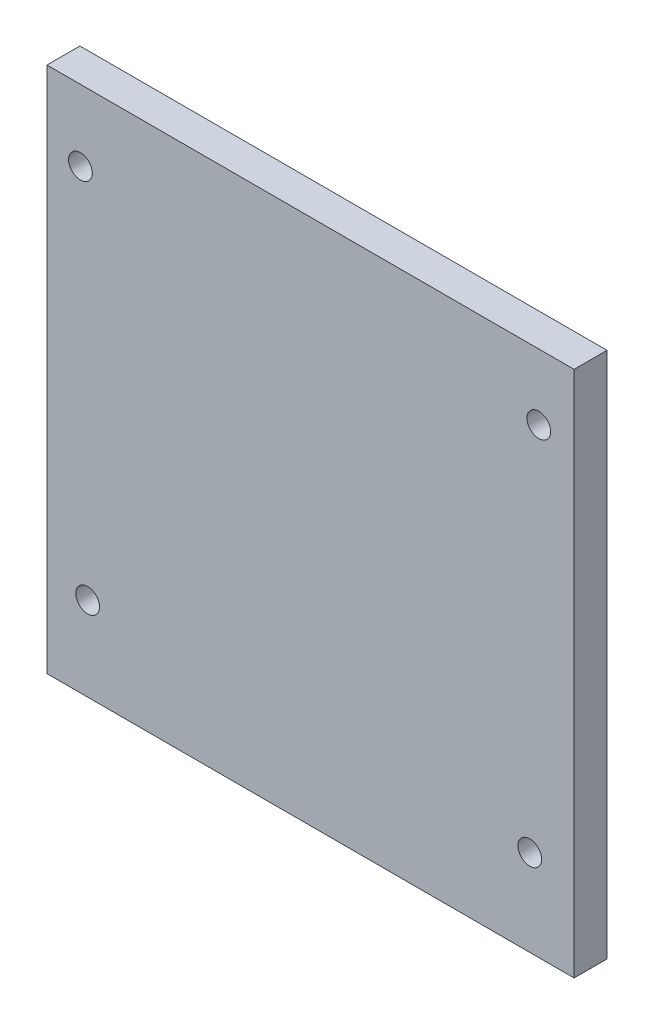
ISO-10303-21;
HEADER;
FILE_DESCRIPTION(('STEP AP214'),'2;1');
FILE_NAME('part.step','',(''),(''),'','','');
FILE_SCHEMA(('AUTOMOTIVE_DESIGN { 1 0 10303 214 1 1 1 1 }'));
ENDSEC;
DATA;
#1=APPLICATION_CONTEXT('core data for automotive mechanical design processes');
#2=APPLICATION_PROTOCOL_DEFINITION('international standard','automotive_design',2000,#1);
#3=PRODUCT_CONTEXT('',#1,'mechanical');
#4=PRODUCT('Part','Part','',(#3));
#5=PRODUCT_RELATED_PRODUCT_CATEGORY('part','',(#4));
#6=PRODUCT_DEFINITION_FORMATION('','',#4);
#7=PRODUCT_DEFINITION_CONTEXT('part definition',#1,'design');
#8=PRODUCT_DEFINITION('design','',#6,#7);
#9=PRODUCT_DEFINITION_SHAPE('','',#8);
#10=(LENGTH_UNIT() NAMED_UNIT(*) SI_UNIT(.MILLI.,.METRE.));
#11=(NAMED_UNIT(*) PLANE_ANGLE_UNIT() SI_UNIT($,.RADIAN.));
#12=(NAMED_UNIT(*) SI_UNIT($,.STERADIAN.) SOLID_ANGLE_UNIT());
#13=UNCERTAINTY_MEASURE_WITH_UNIT(LENGTH_MEASURE(1.E-05),#10,'distance_accuracy_value','');
#14=(GEOMETRIC_REPRESENTATION_CONTEXT(3) GLOBAL_UNCERTAINTY_ASSIGNED_CONTEXT((#13)) GLOBAL_UNIT_ASSIGNED_CONTEXT((#10,
#11,#12)) REPRESENTATION_CONTEXT('',''));
#15=CARTESIAN_POINT('',(0.,0.,0.));
#16=DIRECTION('',(0.,0.,1.));
#17=DIRECTION('',(1.,0.,0.));
#18=AXIS2_PLACEMENT_3D('',#15,#16,#17);
#19=CARTESIAN_POINT('',(50.8,-50.8,6.35));
#20=DIRECTION('',(-1.,0.,0.));
#21=DIRECTION('',(0.,0.,1.));
#22=AXIS2_PLACEMENT_3D('',#19,#20,#21);
#23=PLANE('',#22);
#24=DIRECTION('',(0.,1.,0.));
#25=VECTOR('',#24,1.);
#26=CARTESIAN_POINT('',(50.8,-50.8,0.));
#27=LINE('',#26,#25);
#28=CARTESIAN_POINT('',(50.8,-50.8,0.));
#29=VERTEX_POINT('',#28);
#30=CARTESIAN_POINT('',(50.8,50.8,0.));
#31=VERTEX_POINT('',#30);
#32=EDGE_CURVE('E107',#29,#31,#27,.T.);
#33=ORIENTED_EDGE('',*,*,#32,.T.);
#34=DIRECTION('',(0.,0.,-1.));
#35=VECTOR('',#34,1.);
#36=CARTESIAN_POINT('',(50.8,50.8,6.35));
#37=LINE('',#36,#35);
#38=CARTESIAN_POINT('',(50.8,50.8,6.35));
#39=VERTEX_POINT('',#38);
#40=EDGE_CURVE('E13',#39,#31,#37,.T.);
#41=ORIENTED_EDGE('',*,*,#40,.F.);
#42=DIRECTION('',(0.,1.,0.));
#43=VECTOR('',#42,1.);
#44=CARTESIAN_POINT('',(50.8,-50.8,6.35));
#45=LINE('',#44,#43);
#46=CARTESIAN_POINT('',(50.8,-50.8,6.35));
#47=VERTEX_POINT('',#46);
#48=EDGE_CURVE('E95',#47,#39,#45,.T.);
#49=ORIENTED_EDGE('',*,*,#48,.F.);
#50=DIRECTION('',(0.,0.,-1.));
#51=VECTOR('',#50,1.);
#52=CARTESIAN_POINT('',(50.8,-50.8,6.35));
#53=LINE('',#52,#51);
#54=EDGE_CURVE('E103',#47,#29,#53,.T.);
#55=ORIENTED_EDGE('',*,*,#54,.T.);
#56=EDGE_LOOP('',(#33,#41,#49,#55));
#57=FACE_BOUND('',#56,.T.);
#58=ADVANCED_FACE('F44',(#57),#23,.F.);
#59=CARTESIAN_POINT('',(-50.8,50.8,6.35));
#60=DIRECTION('',(0.,-1.,0.));
#61=DIRECTION('',(0.,0.,-1.));
#62=AXIS2_PLACEMENT_3D('',#59,#60,#61);
#63=PLANE('',#62);
#64=DIRECTION('',(-1.,0.,0.));
#65=VECTOR('',#64,1.);
#66=CARTESIAN_POINT('',(-50.8,50.8,0.));
#67=LINE('',#66,#65);
#68=CARTESIAN_POINT('',(-50.8,50.8,0.));
#69=VERTEX_POINT('',#68);
#70=EDGE_CURVE('E99',#31,#69,#67,.T.);
#71=ORIENTED_EDGE('',*,*,#70,.T.);
#72=DIRECTION('',(0.,0.,-1.));
#73=VECTOR('',#72,1.);
#74=CARTESIAN_POINT('',(-50.8,50.8,6.35));
#75=LINE('',#74,#73);
#76=CARTESIAN_POINT('',(-50.8,50.8,6.35));
#77=VERTEX_POINT('',#76);
#78=EDGE_CURVE('E52',#77,#69,#75,.T.);
#79=ORIENTED_EDGE('',*,*,#78,.F.);
#80=DIRECTION('',(-1.,0.,0.));
#81=VECTOR('',#80,1.);
#82=CARTESIAN_POINT('',(-50.8,50.8,6.35));
#83=LINE('',#82,#81);
#84=EDGE_CURVE('E90',#39,#77,#83,.T.);
#85=ORIENTED_EDGE('',*,*,#84,.F.);
#86=ORIENTED_EDGE('',*,*,#40,.T.);
#87=EDGE_LOOP('',(#71,#79,#85,#86));
#88=FACE_BOUND('',#87,.T.);
#89=ADVANCED_FACE('F98',(#88),#63,.F.);
#90=CARTESIAN_POINT('',(-50.8,-50.8,6.35));
#91=DIRECTION('',(1.,0.,0.));
#92=DIRECTION('',(0.,0.,-1.));
#93=AXIS2_PLACEMENT_3D('',#90,#91,#92);
#94=PLANE('',#93);
#95=DIRECTION('',(0.,-1.,0.));
#96=VECTOR('',#95,1.);
#97=CARTESIAN_POINT('',(-50.8,-50.8,0.));
#98=LINE('',#97,#96);
#99=CARTESIAN_POINT('',(-50.8,-50.8,0.));
#100=VERTEX_POINT('',#99);
#101=EDGE_CURVE('E77',#69,#100,#98,.T.);
#102=ORIENTED_EDGE('',*,*,#101,.T.);
#103=DIRECTION('',(0.,0.,-1.));
#104=VECTOR('',#103,1.);
#105=CARTESIAN_POINT('',(-50.8,-50.8,6.35));
#106=LINE('',#105,#104);
#107=CARTESIAN_POINT('',(-50.8,-50.8,6.35));
#108=VERTEX_POINT('',#107);
#109=EDGE_CURVE('E100',#108,#100,#106,.T.);
#110=ORIENTED_EDGE('',*,*,#109,.F.);
#111=DIRECTION('',(0.,-1.,0.));
#112=VECTOR('',#111,1.);
#113=CARTESIAN_POINT('',(-50.8,-50.8,6.35));
#114=LINE('',#113,#112);
#115=EDGE_CURVE('E93',#77,#108,#114,.T.);
#116=ORIENTED_EDGE('',*,*,#115,.F.);
#117=ORIENTED_EDGE('',*,*,#78,.T.);
#118=EDGE_LOOP('',(#102,#110,#116,#117));
#119=FACE_BOUND('',#118,.T.);
#120=ADVANCED_FACE('F101',(#119),#94,.F.);
#121=CARTESIAN_POINT('',(-50.8,-50.8,6.35));
#122=DIRECTION('',(0.,1.,0.));
#123=DIRECTION('',(0.,0.,1.));
#124=AXIS2_PLACEMENT_3D('',#121,#122,#123);
#125=PLANE('',#124);
#126=DIRECTION('',(1.,0.,0.));
#127=VECTOR('',#126,1.);
#128=CARTESIAN_POINT('',(-50.8,-50.8,0.));
#129=LINE('',#128,#127);
#130=EDGE_CURVE('E83',#100,#29,#129,.T.);
#131=ORIENTED_EDGE('',*,*,#130,.T.);
#132=ORIENTED_EDGE('',*,*,#54,.F.);
#133=DIRECTION('',(1.,0.,0.));
#134=VECTOR('',#133,1.);
#135=CARTESIAN_POINT('',(-50.8,-50.8,6.35));
#136=LINE('',#135,#134);
#137=EDGE_CURVE('E60',#108,#47,#136,.T.);
#138=ORIENTED_EDGE('',*,*,#137,.F.);
#139=ORIENTED_EDGE('',*,*,#109,.T.);
#140=EDGE_LOOP('',(#131,#132,#138,#139));
#141=FACE_BOUND('',#140,.T.);
#142=ADVANCED_FACE('F115',(#141),#125,.F.);
#143=CARTESIAN_POINT('',(50.8,50.8,6.35));
#144=DIRECTION('',(0.,0.,-1.));
#145=DIRECTION('',(-1.,0.,0.));
#146=AXIS2_PLACEMENT_3D('',#143,#144,#145);
#147=PLANE('',#146);
#148=CARTESIAN_POINT('',(44.0090303467282,38.1285118971272,6.35));
#149=DIRECTION('',(0.,0.,-1.));
#150=DIRECTION('',(-1.,0.,0.));
#151=AXIS2_PLACEMENT_3D('',#148,#149,#150);
#152=CIRCLE('',#151,2.28600000000002);
#153=CARTESIAN_POINT('',(41.7230303467282,38.1285118971272,6.35));
#154=VERTEX_POINT('',#153);
#155=EDGE_CURVE('E136',#154,#154,#152,.T.);
#156=ORIENTED_EDGE('',*,*,#155,.T.);
#157=EDGE_LOOP('',(#156));
#158=FACE_BOUND('',#157,.T.);
#159=CARTESIAN_POINT('',(-44.353227793716,37.1056835467021,6.35));
#160=DIRECTION('',(0.,0.,-1.));
#161=DIRECTION('',(-1.,0.,0.));
#162=AXIS2_PLACEMENT_3D('',#159,#160,#161);
#163=CIRCLE('',#162,2.28599999999999);
#164=CARTESIAN_POINT('',(-46.639227793716,37.1056835467021,6.35));
#165=VERTEX_POINT('',#164);
#166=EDGE_CURVE('E130',#165,#165,#163,.T.);
#167=ORIENTED_EDGE('',*,*,#166,.T.);
#168=EDGE_LOOP('',(#167));
#169=FACE_BOUND('',#168,.T.);
#170=CARTESIAN_POINT('',(-42.9593904100147,-34.6109884749345,6.35));
#171=DIRECTION('',(0.,0.,-1.));
#172=DIRECTION('',(-1.,0.,0.));
#173=AXIS2_PLACEMENT_3D('',#170,#171,#172);
#174=CIRCLE('',#173,2.28599999999999);
#175=CARTESIAN_POINT('',(-45.2453904100147,-34.6109884749345,6.35));
#176=VERTEX_POINT('',#175);
#177=EDGE_CURVE('E124',#176,#176,#174,.T.);
#178=ORIENTED_EDGE('',*,*,#177,.T.);
#179=EDGE_LOOP('',(#178));
#180=FACE_BOUND('',#179,.T.);
#181=CARTESIAN_POINT('',(42.2593123668721,-34.1231147195169,6.35));
#182=DIRECTION('',(0.,0.,-1.));
#183=DIRECTION('',(-1.,0.,0.));
#184=AXIS2_PLACEMENT_3D('',#181,#182,#183);
#185=CIRCLE('',#184,2.28599999999998);
#186=CARTESIAN_POINT('',(39.9733123668721,-34.1231147195169,6.35));
#187=VERTEX_POINT('',#186);
#188=EDGE_CURVE('E110',#187,#187,#185,.T.);
#189=ORIENTED_EDGE('',*,*,#188,.T.);
#190=EDGE_LOOP('',(#189));
#191=FACE_BOUND('',#190,.T.);
#192=ORIENTED_EDGE('',*,*,#48,.T.);
#193=ORIENTED_EDGE('',*,*,#84,.T.);
#194=ORIENTED_EDGE('',*,*,#115,.T.);
#195=ORIENTED_EDGE('',*,*,#137,.T.);
#196=EDGE_LOOP('',(#192,#193,#194,#195));
#197=FACE_BOUND('',#196,.T.);
#198=ADVANCED_FACE('F91',(#158,#169,#180,#191,#197),#147,.F.);
#199=CARTESIAN_POINT('',(50.8,50.8,0.));
#200=DIRECTION('',(0.,0.,-1.));
#201=DIRECTION('',(-1.,0.,0.));
#202=AXIS2_PLACEMENT_3D('',#199,#200,#201);
#203=PLANE('',#202);
#204=CARTESIAN_POINT('',(44.0090303467282,38.1285118971272,0.));
#205=DIRECTION('',(0.,0.,-1.));
#206=DIRECTION('',(-1.,0.,0.));
#207=AXIS2_PLACEMENT_3D('',#204,#205,#206);
#208=CIRCLE('',#207,2.28600000000002);
#209=CARTESIAN_POINT('',(41.7230303467282,38.1285118971272,0.));
#210=VERTEX_POINT('',#209);
#211=EDGE_CURVE('E139',#210,#210,#208,.T.);
#212=ORIENTED_EDGE('',*,*,#211,.F.);
#213=EDGE_LOOP('',(#212));
#214=FACE_BOUND('',#213,.T.);
#215=CARTESIAN_POINT('',(-44.353227793716,37.1056835467021,0.));
#216=DIRECTION('',(0.,0.,-1.));
#217=DIRECTION('',(-1.,0.,0.));
#218=AXIS2_PLACEMENT_3D('',#215,#216,#217);
#219=CIRCLE('',#218,2.28599999999999);
#220=CARTESIAN_POINT('',(-46.639227793716,37.1056835467021,0.));
#221=VERTEX_POINT('',#220);
#222=EDGE_CURVE('E133',#221,#221,#219,.T.);
#223=ORIENTED_EDGE('',*,*,#222,.F.);
#224=EDGE_LOOP('',(#223));
#225=FACE_BOUND('',#224,.T.);
#226=CARTESIAN_POINT('',(-42.9593904100147,-34.6109884749345,0.));
#227=DIRECTION('',(0.,0.,-1.));
#228=DIRECTION('',(-1.,0.,0.));
#229=AXIS2_PLACEMENT_3D('',#226,#227,#228);
#230=CIRCLE('',#229,2.28599999999999);
#231=CARTESIAN_POINT('',(-45.2453904100147,-34.6109884749345,0.));
#232=VERTEX_POINT('',#231);
#233=EDGE_CURVE('E127',#232,#232,#230,.T.);
#234=ORIENTED_EDGE('',*,*,#233,.F.);
#235=EDGE_LOOP('',(#234));
#236=FACE_BOUND('',#235,.T.);
#237=CARTESIAN_POINT('',(42.2593123668721,-34.1231147195169,0.));
#238=DIRECTION('',(0.,0.,-1.));
#239=DIRECTION('',(-1.,0.,0.));
#240=AXIS2_PLACEMENT_3D('',#237,#238,#239);
#241=CIRCLE('',#240,2.28599999999998);
#242=CARTESIAN_POINT('',(39.9733123668721,-34.1231147195169,0.));
#243=VERTEX_POINT('',#242);
#244=EDGE_CURVE('E121',#243,#243,#241,.T.);
#245=ORIENTED_EDGE('',*,*,#244,.F.);
#246=EDGE_LOOP('',(#245));
#247=FACE_BOUND('',#246,.T.);
#248=ORIENTED_EDGE('',*,*,#32,.F.);
#249=ORIENTED_EDGE('',*,*,#130,.F.);
#250=ORIENTED_EDGE('',*,*,#101,.F.);
#251=ORIENTED_EDGE('',*,*,#70,.F.);
#252=EDGE_LOOP('',(#248,#249,#250,#251));
#253=FACE_BOUND('',#252,.T.);
#254=ADVANCED_FACE('F118',(#214,#225,#236,#247,#253),#203,.T.);
#255=CARTESIAN_POINT('',(42.2593123668721,-34.1231147195169,6.35));
#256=DIRECTION('',(0.,0.,-1.));
#257=DIRECTION('',(-1.,0.,0.));
#258=AXIS2_PLACEMENT_3D('',#255,#256,#257);
#259=CYLINDRICAL_SURFACE('',#258,2.28599999999998);
#260=ORIENTED_EDGE('',*,*,#188,.F.);
#261=EDGE_LOOP('',(#260));
#262=FACE_BOUND('',#261,.T.);
#263=ORIENTED_EDGE('',*,*,#244,.T.);
#264=EDGE_LOOP('',(#263));
#265=FACE_BOUND('',#264,.T.);
#266=ADVANCED_FACE('F156',(#262,#265),#259,.F.);
#267=CARTESIAN_POINT('',(-42.9593904100147,-34.6109884749345,6.35));
#268=DIRECTION('',(0.,0.,-1.));
#269=DIRECTION('',(-1.,0.,0.));
#270=AXIS2_PLACEMENT_3D('',#267,#268,#269);
#271=CYLINDRICAL_SURFACE('',#270,2.28599999999999);
#272=ORIENTED_EDGE('',*,*,#177,.F.);
#273=EDGE_LOOP('',(#272));
#274=FACE_BOUND('',#273,.T.);
#275=ORIENTED_EDGE('',*,*,#233,.T.);
#276=EDGE_LOOP('',(#275));
#277=FACE_BOUND('',#276,.T.);
#278=ADVANCED_FACE('F165',(#274,#277),#271,.F.);
#279=CARTESIAN_POINT('',(-44.353227793716,37.1056835467021,6.35));
#280=DIRECTION('',(0.,0.,-1.));
#281=DIRECTION('',(-1.,0.,0.));
#282=AXIS2_PLACEMENT_3D('',#279,#280,#281);
#283=CYLINDRICAL_SURFACE('',#282,2.28599999999999);
#284=ORIENTED_EDGE('',*,*,#166,.F.);
#285=EDGE_LOOP('',(#284));
#286=FACE_BOUND('',#285,.T.);
#287=ORIENTED_EDGE('',*,*,#222,.T.);
#288=EDGE_LOOP('',(#287));
#289=FACE_BOUND('',#288,.T.);
#290=ADVANCED_FACE('F150',(#286,#289),#283,.F.);
#291=CARTESIAN_POINT('',(44.0090303467282,38.1285118971272,6.35));
#292=DIRECTION('',(0.,0.,-1.));
#293=DIRECTION('',(-1.,0.,0.));
#294=AXIS2_PLACEMENT_3D('',#291,#292,#293);
#295=CYLINDRICAL_SURFACE('',#294,2.28600000000002);
#296=ORIENTED_EDGE('',*,*,#155,.F.);
#297=EDGE_LOOP('',(#296));
#298=FACE_BOUND('',#297,.T.);
#299=ORIENTED_EDGE('',*,*,#211,.T.);
#300=EDGE_LOOP('',(#299));
#301=FACE_BOUND('',#300,.T.);
#302=ADVANCED_FACE('F147',(#298,#301),#295,.F.);
#303=CLOSED_SHELL('',(#58,#89,#120,#142,#198,#254,#266,#278,#290,#302));
#304=MANIFOLD_SOLID_BREP('B2',#303);
#305=ADVANCED_BREP_SHAPE_REPRESENTATION('',(#18,#304),#14);
#306=SHAPE_DEFINITION_REPRESENTATION(#9,#305);
ENDSEC;
END-ISO-10303-21;
